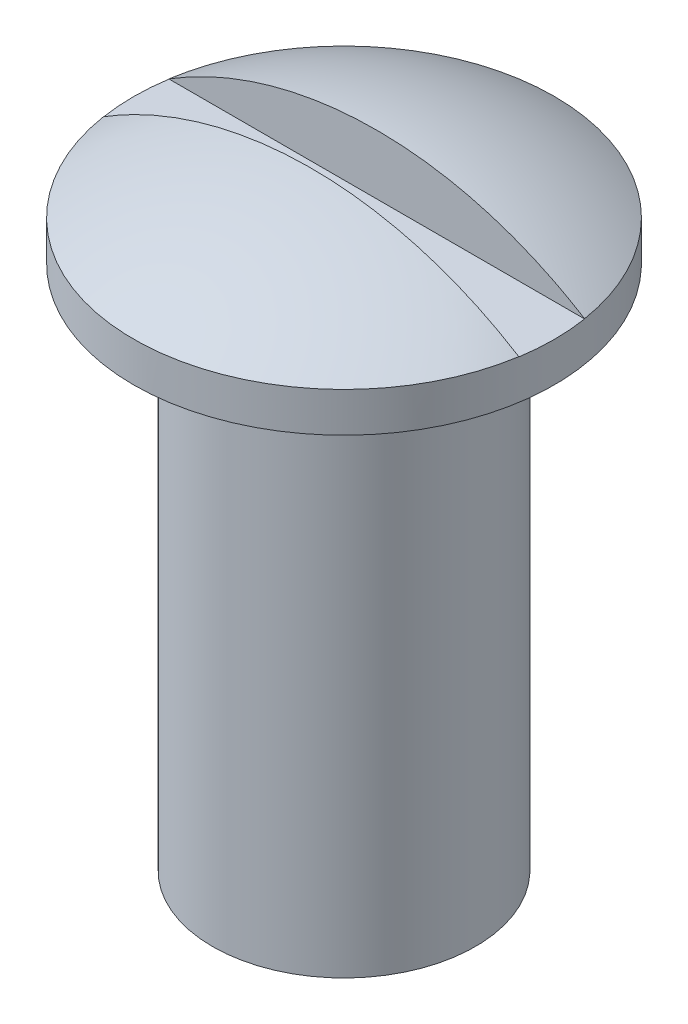
ISO-10303-21;
HEADER;
FILE_DESCRIPTION(('STEP AP214'),'2;1');
FILE_NAME('part.step','',(''),(''),'','','');
FILE_SCHEMA(('AUTOMOTIVE_DESIGN { 1 0 10303 214 1 1 1 1 }'));
ENDSEC;
DATA;
#1=APPLICATION_CONTEXT('core data for automotive mechanical design processes');
#2=APPLICATION_PROTOCOL_DEFINITION('international standard','automotive_design',2000,#1);
#3=PRODUCT_CONTEXT('',#1,'mechanical');
#4=PRODUCT('Part','Part','',(#3));
#5=PRODUCT_RELATED_PRODUCT_CATEGORY('part','',(#4));
#6=PRODUCT_DEFINITION_FORMATION('','',#4);
#7=PRODUCT_DEFINITION_CONTEXT('part definition',#1,'design');
#8=PRODUCT_DEFINITION('design','',#6,#7);
#9=PRODUCT_DEFINITION_SHAPE('','',#8);
#10=(LENGTH_UNIT() NAMED_UNIT(*) SI_UNIT(.MILLI.,.METRE.));
#11=(NAMED_UNIT(*) PLANE_ANGLE_UNIT() SI_UNIT($,.RADIAN.));
#12=(NAMED_UNIT(*) SI_UNIT($,.STERADIAN.) SOLID_ANGLE_UNIT());
#13=UNCERTAINTY_MEASURE_WITH_UNIT(LENGTH_MEASURE(1.E-05),#10,'distance_accuracy_value','');
#14=(GEOMETRIC_REPRESENTATION_CONTEXT(3) GLOBAL_UNCERTAINTY_ASSIGNED_CONTEXT((#13)) GLOBAL_UNIT_ASSIGNED_CONTEXT((#10,
#11,#12)) REPRESENTATION_CONTEXT('',''));
#15=CARTESIAN_POINT('',(0.,0.,0.));
#16=DIRECTION('',(0.,0.,1.));
#17=DIRECTION('',(1.,0.,0.));
#18=AXIS2_PLACEMENT_3D('',#15,#16,#17);
#19=CARTESIAN_POINT('',(-5.,4.3,0.25));
#20=DIRECTION('',(0.,-1.,0.));
#21=DIRECTION('',(0.,0.,-1.));
#22=AXIS2_PLACEMENT_3D('',#19,#20,#21);
#23=PLANE('',#22);
#24=DIRECTION('',(1.,0.,0.));
#25=VECTOR('',#24,1.);
#26=CARTESIAN_POINT('',(-5.,4.3,0.25));
#27=LINE('',#26,#25);
#28=CARTESIAN_POINT('',(-1.58034806292791,4.3,0.25));
#29=VERTEX_POINT('',#28);
#30=CARTESIAN_POINT('',(1.58034806292791,4.3,0.25));
#31=VERTEX_POINT('',#30);
#32=EDGE_CURVE('E68',#29,#31,#27,.T.);
#33=ORIENTED_EDGE('',*,*,#32,.T.);
#34=CARTESIAN_POINT('',(0.,4.3,0.));
#35=DIRECTION('',(0.,-1.,0.));
#36=DIRECTION('',(0.,0.,-1.));
#37=AXIS2_PLACEMENT_3D('',#34,#35,#36);
#38=CIRCLE('',#37,1.6);
#39=CARTESIAN_POINT('',(1.58034806292791,4.3,-0.25));
#40=VERTEX_POINT('',#39);
#41=EDGE_CURVE('E20',#40,#31,#38,.T.);
#42=ORIENTED_EDGE('',*,*,#41,.F.);
#43=DIRECTION('',(1.,0.,0.));
#44=VECTOR('',#43,1.);
#45=CARTESIAN_POINT('',(-5.,4.3,-0.25));
#46=LINE('',#45,#44);
#47=CARTESIAN_POINT('',(-1.58034806292791,4.3,-0.25));
#48=VERTEX_POINT('',#47);
#49=EDGE_CURVE('E77',#40,#48,#46,.F.);
#50=ORIENTED_EDGE('',*,*,#49,.T.);
#51=CARTESIAN_POINT('',(0.,4.3,0.));
#52=DIRECTION('',(0.,-1.,0.));
#53=DIRECTION('',(0.,0.,-1.));
#54=AXIS2_PLACEMENT_3D('',#51,#52,#53);
#55=CIRCLE('',#54,1.6);
#56=EDGE_CURVE('E66',#29,#48,#55,.T.);
#57=ORIENTED_EDGE('',*,*,#56,.F.);
#58=EDGE_LOOP('',(#33,#42,#50,#57));
#59=FACE_BOUND('',#58,.T.);
#60=ADVANCED_FACE('F17',(#59),#23,.F.);
#61=CARTESIAN_POINT('',(-5.,7.74008606997639,0.25));
#62=DIRECTION('',(0.,0.,1.));
#63=DIRECTION('',(0.,-1.,0.));
#64=AXIS2_PLACEMENT_3D('',#61,#62,#63);
#65=PLANE('',#64);
#66=CARTESIAN_POINT('',(1.58034806292791,4.30164753059011,0.25));
#67=CARTESIAN_POINT('',(1.50896794192082,4.34610861428904,0.25));
#68=CARTESIAN_POINT('',(1.43570681975758,4.3875420096168,0.25));
#69=CARTESIAN_POINT('',(1.28595983077063,4.4640923764717,0.25));
#70=CARTESIAN_POINT('',(1.20947411392197,4.49920964136124,0.25));
#71=CARTESIAN_POINT('',(1.05388269257591,4.56284052203379,0.25));
#72=CARTESIAN_POINT('',(0.97477955639264,4.59136040392946,0.25));
#73=CARTESIAN_POINT('',(0.814477319074666,4.64163815599035,0.25));
#74=CARTESIAN_POINT('',(0.733278248580179,4.66339612494663,0.25));
#75=CARTESIAN_POINT('',(0.487317207479069,4.71828192564555,0.25));
#76=CARTESIAN_POINT('',(0.320112701366049,4.74105375588651,0.25));
#77=CARTESIAN_POINT('',(-0.0157002429055117,4.75818643483343,0.25));
#78=CARTESIAN_POINT('',(-0.184308982216372,4.75254102390361,0.25));
#79=CARTESIAN_POINT('',(-0.518284533434301,4.71302984845866,0.249999999999999));
#80=CARTESIAN_POINT('',(-0.683649282697956,4.6791466889636,0.249999999999999));
#81=CARTESIAN_POINT('',(-1.00619884910442,4.58408251245316,0.250000000000001));
#82=CARTESIAN_POINT('',(-1.16339519713547,4.52294121142541,0.250000000000004));
#83=CARTESIAN_POINT('',(-1.35978607636399,4.42683982790208,0.249999999999999));
#84=CARTESIAN_POINT('',(-1.40482812591175,4.40335331488489,0.249999999999997));
#85=CARTESIAN_POINT('',(-1.49358219629261,4.35415867612933,0.250000000000002));
#86=CARTESIAN_POINT('',(-1.53729634829711,4.32845439558375,0.25000000000001));
#87=CARTESIAN_POINT('',(-1.58034806292791,4.30164753059011,0.250000000000027));
#88=B_SPLINE_CURVE_WITH_KNOTS('',3,(#66,#67,#68,#69,#70,#71,#72,#73,#74,#75,#76,#77,#78,#79,#80,
#81,#82,#83,#84,#85,#86,#87),.UNSPECIFIED.,.F.,.F.,(4,2,2,2,2,2,2,2,2,2,4),(0.,
0.252201922151327,0.504392127369465,0.756341812878911,1.00828781724905,1.51192803419273,
2.0156791958351,2.51974090717012,3.02307057255868,3.17541854643481,3.32750749068285),.UNSPECIFIED.);
#89=CARTESIAN_POINT('',(1.58034806292791,4.30164753059011,0.25));
#90=VERTEX_POINT('',#89);
#91=CARTESIAN_POINT('',(-1.58034806292791,4.30164753059011,0.25));
#92=VERTEX_POINT('',#91);
#93=EDGE_CURVE('E74',#90,#92,#88,.T.);
#94=ORIENTED_EDGE('',*,*,#93,.F.);
#95=DIRECTION('',(0.,-1.,0.));
#96=VECTOR('',#95,1.);
#97=CARTESIAN_POINT('',(1.58034806292791,2.79579606906158,0.25));
#98=LINE('',#97,#96);
#99=EDGE_CURVE('E61',#31,#90,#98,.F.);
#100=ORIENTED_EDGE('',*,*,#99,.F.);
#101=ORIENTED_EDGE('',*,*,#32,.F.);
#102=DIRECTION('',(0.,-1.,0.));
#103=VECTOR('',#102,1.);
#104=CARTESIAN_POINT('',(-1.58034806292791,2.79579606906158,0.25));
#105=LINE('',#104,#103);
#106=EDGE_CURVE('E75',#92,#29,#105,.T.);
#107=ORIENTED_EDGE('',*,*,#106,.F.);
#108=EDGE_LOOP('',(#94,#100,#101,#107));
#109=FACE_BOUND('',#108,.T.);
#110=ADVANCED_FACE('F72',(#109),#65,.F.);
#111=CARTESIAN_POINT('',(-5.,7.74008606997639,-0.25));
#112=DIRECTION('',(0.,0.,-1.));
#113=DIRECTION('',(0.,1.,0.));
#114=AXIS2_PLACEMENT_3D('',#111,#112,#113);
#115=PLANE('',#114);
#116=CARTESIAN_POINT('',(-1.58034806292791,4.30164753059011,-0.250000000000001));
#117=CARTESIAN_POINT('',(-1.50896794192082,4.34610861428904,-0.250000000000001));
#118=CARTESIAN_POINT('',(-1.43570681975758,4.3875420096168,-0.250000000000001));
#119=CARTESIAN_POINT('',(-1.28595983077063,4.4640923764717,-0.25));
#120=CARTESIAN_POINT('',(-1.20947411392198,4.49920964136123,-0.25));
#121=CARTESIAN_POINT('',(-1.05388269257591,4.56284052203379,-0.25));
#122=CARTESIAN_POINT('',(-0.974779556392641,4.59136040392946,-0.25));
#123=CARTESIAN_POINT('',(-0.814477319074667,4.64163815599035,-0.25));
#124=CARTESIAN_POINT('',(-0.73327824858018,4.66339612494663,-0.25));
#125=CARTESIAN_POINT('',(-0.48731720747907,4.71828192564555,-0.25));
#126=CARTESIAN_POINT('',(-0.32011270136605,4.74105375588651,-0.25));
#127=CARTESIAN_POINT('',(0.0157002429055106,4.75818643483343,-0.250000000000001));
#128=CARTESIAN_POINT('',(0.184308982216371,4.75254102390361,-0.250000000000001));
#129=CARTESIAN_POINT('',(0.518284533434301,4.71302984845866,-0.250000000000001));
#130=CARTESIAN_POINT('',(0.683649282697955,4.6791466889636,-0.25));
#131=CARTESIAN_POINT('',(1.00619884910442,4.58408251245316,-0.250000000000001));
#132=CARTESIAN_POINT('',(1.16339519713546,4.52294121142541,-0.250000000000001));
#133=CARTESIAN_POINT('',(1.35978607636399,4.42683982790208,-0.249999999999998));
#134=CARTESIAN_POINT('',(1.40482812591175,4.40335331488489,-0.249999999999997));
#135=CARTESIAN_POINT('',(1.49358219629261,4.35415867612933,-0.250000000000004));
#136=CARTESIAN_POINT('',(1.53729634829711,4.32845439558375,-0.250000000000012));
#137=CARTESIAN_POINT('',(1.58034806292791,4.30164753059011,-0.250000000000029));
#138=B_SPLINE_CURVE_WITH_KNOTS('',3,(#116,#117,#118,#119,#120,#121,#122,#123,#124,#125,#126,
#127,#128,#129,#130,#131,#132,#133,#134,#135,#136,#137),.UNSPECIFIED.,.F.,.F.,(4,2,2,2,2,2,2,2,
2,2,4),(0.,0.252201922151327,0.504392127369464,0.756341812878911,1.00828781724905,
1.51192803419273,2.0156791958351,2.51974090717012,3.02307057255868,3.17541854643481,
3.32750749068285),.UNSPECIFIED.);
#139=CARTESIAN_POINT('',(-1.58034806292791,4.30164753059011,-0.250000000000001));
#140=VERTEX_POINT('',#139);
#141=CARTESIAN_POINT('',(1.58034806292791,4.30164753059011,-0.250000000000001));
#142=VERTEX_POINT('',#141);
#143=EDGE_CURVE('E84',#140,#142,#138,.T.);
#144=ORIENTED_EDGE('',*,*,#143,.F.);
#145=DIRECTION('',(0.,-1.,0.));
#146=VECTOR('',#145,1.);
#147=CARTESIAN_POINT('',(-1.58034806292791,2.79579606906158,-0.25));
#148=LINE('',#147,#146);
#149=EDGE_CURVE('E35',#48,#140,#148,.F.);
#150=ORIENTED_EDGE('',*,*,#149,.F.);
#151=ORIENTED_EDGE('',*,*,#49,.F.);
#152=DIRECTION('',(0.,-1.,0.));
#153=VECTOR('',#152,1.);
#154=CARTESIAN_POINT('',(1.58034806292791,2.79579606906158,-0.25));
#155=LINE('',#154,#153);
#156=EDGE_CURVE('E64',#142,#40,#155,.T.);
#157=ORIENTED_EDGE('',*,*,#156,.F.);
#158=EDGE_LOOP('',(#144,#150,#151,#157));
#159=FACE_BOUND('',#158,.T.);
#160=ADVANCED_FACE('F82',(#159),#115,.F.);
#161=CARTESIAN_POINT('',(0.,1.76393202250021,0.));
#162=DIRECTION('',(1.,0.,0.));
#163=DIRECTION('',(0.,1.,0.));
#164=AXIS2_PLACEMENT_3D('',#161,#162,#163);
#165=SPHERICAL_SURFACE('',#164,3.);
#166=CARTESIAN_POINT('',(0.,4.30164753059011,0.));
#167=DIRECTION('',(0.,-1.,0.));
#168=DIRECTION('',(0.,0.,-1.));
#169=AXIS2_PLACEMENT_3D('',#166,#167,#168);
#170=CIRCLE('',#169,1.6);
#171=EDGE_CURVE('E119',#90,#92,#170,.T.);
#172=ORIENTED_EDGE('',*,*,#171,.F.);
#173=ORIENTED_EDGE('',*,*,#93,.T.);
#174=EDGE_LOOP('',(#172,#173));
#175=FACE_BOUND('',#174,.T.);
#176=ADVANCED_FACE('F100',(#175),#165,.T.);
#177=CARTESIAN_POINT('',(0.,1.76393202250021,0.));
#178=DIRECTION('',(1.,0.,0.));
#179=DIRECTION('',(0.,1.,0.));
#180=AXIS2_PLACEMENT_3D('',#177,#178,#179);
#181=SPHERICAL_SURFACE('',#180,3.);
#182=ORIENTED_EDGE('',*,*,#143,.T.);
#183=CARTESIAN_POINT('',(0.,4.30164753059011,0.));
#184=DIRECTION('',(0.,-1.,0.));
#185=DIRECTION('',(0.,0.,-1.));
#186=AXIS2_PLACEMENT_3D('',#183,#184,#185);
#187=CIRCLE('',#186,1.6);
#188=EDGE_CURVE('E118',#140,#142,#187,.T.);
#189=ORIENTED_EDGE('',*,*,#188,.F.);
#190=EDGE_LOOP('',(#182,#189));
#191=FACE_BOUND('',#190,.T.);
#192=ADVANCED_FACE('F104',(#191),#181,.T.);
#193=CARTESIAN_POINT('',(0.,2.79579606906158,0.));
#194=DIRECTION('',(0.,-1.,0.));
#195=DIRECTION('',(0.,0.,-1.));
#196=AXIS2_PLACEMENT_3D('',#193,#194,#195);
#197=CYLINDRICAL_SURFACE('',#196,1.6);
#198=ORIENTED_EDGE('',*,*,#99,.T.);
#199=ORIENTED_EDGE('',*,*,#171,.T.);
#200=ORIENTED_EDGE('',*,*,#106,.T.);
#201=ORIENTED_EDGE('',*,*,#56,.T.);
#202=ORIENTED_EDGE('',*,*,#149,.T.);
#203=ORIENTED_EDGE('',*,*,#188,.T.);
#204=ORIENTED_EDGE('',*,*,#156,.T.);
#205=ORIENTED_EDGE('',*,*,#41,.T.);
#206=EDGE_LOOP('',(#198,#199,#200,#201,#202,#203,#204,#205));
#207=FACE_BOUND('',#206,.T.);
#208=CARTESIAN_POINT('',(0.,4.,0.));
#209=DIRECTION('',(0.,-1.,0.));
#210=DIRECTION('',(0.,0.,-1.));
#211=AXIS2_PLACEMENT_3D('',#208,#209,#210);
#212=CIRCLE('',#211,1.6);
#213=CARTESIAN_POINT('',(0.,4.,-1.6));
#214=VERTEX_POINT('',#213);
#215=EDGE_CURVE('E115',#214,#214,#212,.T.);
#216=ORIENTED_EDGE('',*,*,#215,.F.);
#217=EDGE_LOOP('',(#216));
#218=FACE_BOUND('',#217,.T.);
#219=ADVANCED_FACE('F57',(#207,#218),#197,.T.);
#220=CARTESIAN_POINT('',(1.,4.,0.));
#221=DIRECTION('',(0.,-1.,0.));
#222=DIRECTION('',(0.,0.,-1.));
#223=AXIS2_PLACEMENT_3D('',#220,#221,#222);
#224=PLANE('',#223);
#225=CARTESIAN_POINT('',(0.,4.,0.));
#226=DIRECTION('',(0.,-1.,0.));
#227=DIRECTION('',(0.,0.,-1.));
#228=AXIS2_PLACEMENT_3D('',#225,#226,#227);
#229=CIRCLE('',#228,1.);
#230=CARTESIAN_POINT('',(0.,4.,-1.));
#231=VERTEX_POINT('',#230);
#232=EDGE_CURVE('E26',#231,#231,#229,.T.);
#233=ORIENTED_EDGE('',*,*,#232,.F.);
#234=EDGE_LOOP('',(#233));
#235=FACE_BOUND('',#234,.T.);
#236=ORIENTED_EDGE('',*,*,#215,.T.);
#237=EDGE_LOOP('',(#236));
#238=FACE_BOUND('',#237,.T.);
#239=ADVANCED_FACE('F126',(#235,#238),#224,.T.);
#240=CARTESIAN_POINT('',(0.,0.,0.));
#241=DIRECTION('',(0.,-1.,0.));
#242=DIRECTION('',(0.,0.,-1.));
#243=AXIS2_PLACEMENT_3D('',#240,#241,#242);
#244=PLANE('',#243);
#245=CARTESIAN_POINT('',(0.,0.,0.));
#246=DIRECTION('',(0.,-1.,0.));
#247=DIRECTION('',(0.,0.,-1.));
#248=AXIS2_PLACEMENT_3D('',#245,#246,#247);
#249=CIRCLE('',#248,1.);
#250=CARTESIAN_POINT('',(0.,0.,-1.));
#251=VERTEX_POINT('',#250);
#252=EDGE_CURVE('E11',#251,#251,#249,.F.);
#253=ORIENTED_EDGE('',*,*,#252,.F.);
#254=EDGE_LOOP('',(#253));
#255=FACE_BOUND('',#254,.T.);
#256=ADVANCED_FACE('F129',(#255),#244,.T.);
#257=CARTESIAN_POINT('',(0.,2.79579606906158,0.));
#258=DIRECTION('',(0.,-1.,0.));
#259=DIRECTION('',(0.,0.,-1.));
#260=AXIS2_PLACEMENT_3D('',#257,#258,#259);
#261=CYLINDRICAL_SURFACE('',#260,1.);
#262=ORIENTED_EDGE('',*,*,#252,.T.);
#263=EDGE_LOOP('',(#262));
#264=FACE_BOUND('',#263,.T.);
#265=ORIENTED_EDGE('',*,*,#232,.T.);
#266=EDGE_LOOP('',(#265));
#267=FACE_BOUND('',#266,.T.);
#268=ADVANCED_FACE('F127',(#264,#267),#261,.T.);
#269=CLOSED_SHELL('',(#60,#110,#160,#176,#192,#219,#239,#256,#268));
#270=MANIFOLD_SOLID_BREP('B1',#269);
#271=ADVANCED_BREP_SHAPE_REPRESENTATION('',(#18,#270),#14);
#272=SHAPE_DEFINITION_REPRESENTATION(#9,#271);
ENDSEC;
END-ISO-10303-21;
